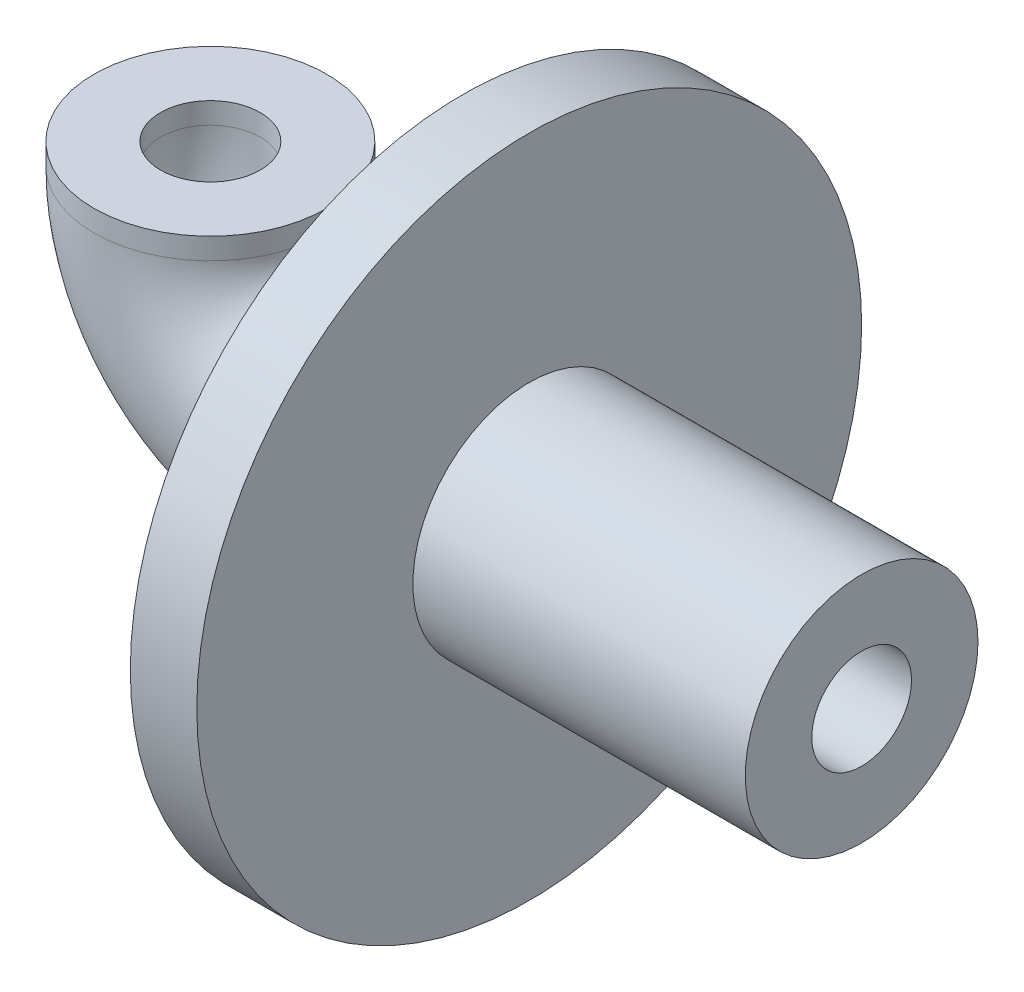
ISO-10303-21;
HEADER;
FILE_DESCRIPTION(('STEP AP214'),'2;1');
FILE_NAME('part.step','',(''),(''),'','','');
FILE_SCHEMA(('AUTOMOTIVE_DESIGN { 1 0 10303 214 1 1 1 1 }'));
ENDSEC;
DATA;
#1=APPLICATION_CONTEXT('core data for automotive mechanical design processes');
#2=APPLICATION_PROTOCOL_DEFINITION('international standard','automotive_design',2000,#1);
#3=PRODUCT_CONTEXT('',#1,'mechanical');
#4=PRODUCT('Part','Part','',(#3));
#5=PRODUCT_RELATED_PRODUCT_CATEGORY('part','',(#4));
#6=PRODUCT_DEFINITION_FORMATION('','',#4);
#7=PRODUCT_DEFINITION_CONTEXT('part definition',#1,'design');
#8=PRODUCT_DEFINITION('design','',#6,#7);
#9=PRODUCT_DEFINITION_SHAPE('','',#8);
#10=(LENGTH_UNIT() NAMED_UNIT(*) SI_UNIT(.MILLI.,.METRE.));
#11=(NAMED_UNIT(*) PLANE_ANGLE_UNIT() SI_UNIT($,.RADIAN.));
#12=(NAMED_UNIT(*) SI_UNIT($,.STERADIAN.) SOLID_ANGLE_UNIT());
#13=UNCERTAINTY_MEASURE_WITH_UNIT(LENGTH_MEASURE(1.E-05),#10,'distance_accuracy_value','');
#14=(GEOMETRIC_REPRESENTATION_CONTEXT(3) GLOBAL_UNCERTAINTY_ASSIGNED_CONTEXT((#13)) GLOBAL_UNIT_ASSIGNED_CONTEXT((#10,
#11,#12)) REPRESENTATION_CONTEXT('',''));
#15=CARTESIAN_POINT('',(0.,0.,0.));
#16=DIRECTION('',(0.,0.,1.));
#17=DIRECTION('',(1.,0.,0.));
#18=AXIS2_PLACEMENT_3D('',#15,#16,#17);
#19=CARTESIAN_POINT('',(1.,0.,0.));
#20=DIRECTION('',(-1.,0.,0.));
#21=DIRECTION('',(0.,0.,1.));
#22=AXIS2_PLACEMENT_3D('',#19,#20,#21);
#23=CYLINDRICAL_SURFACE('',#22,5.);
#24=CARTESIAN_POINT('',(1.,0.,0.));
#25=DIRECTION('',(1.,0.,0.));
#26=DIRECTION('',(0.,0.,-1.));
#27=AXIS2_PLACEMENT_3D('',#24,#25,#26);
#28=CIRCLE('',#27,5.);
#29=CARTESIAN_POINT('',(1.,0.,-5.));
#30=VERTEX_POINT('',#29);
#31=EDGE_CURVE('E44',#30,#30,#28,.T.);
#32=ORIENTED_EDGE('',*,*,#31,.F.);
#33=EDGE_LOOP('',(#32));
#34=FACE_BOUND('',#33,.T.);
#35=CARTESIAN_POINT('',(0.,0.,0.));
#36=DIRECTION('',(1.,0.,0.));
#37=DIRECTION('',(0.,0.,-1.));
#38=AXIS2_PLACEMENT_3D('',#35,#36,#37);
#39=CIRCLE('',#38,5.);
#40=CARTESIAN_POINT('',(0.,0.,-5.));
#41=VERTEX_POINT('',#40);
#42=EDGE_CURVE('E40',#41,#41,#39,.T.);
#43=ORIENTED_EDGE('',*,*,#42,.T.);
#44=EDGE_LOOP('',(#43));
#45=FACE_BOUND('',#44,.T.);
#46=ADVANCED_FACE('F37',(#34,#45),#23,.T.);
#47=CARTESIAN_POINT('',(1.,0.,0.));
#48=DIRECTION('',(1.,0.,0.));
#49=DIRECTION('',(0.,0.,-1.));
#50=AXIS2_PLACEMENT_3D('',#47,#48,#49);
#51=PLANE('',#50);
#52=CARTESIAN_POINT('',(1.,0.,0.));
#53=DIRECTION('',(1.,0.,0.));
#54=DIRECTION('',(0.,0.,-1.));
#55=AXIS2_PLACEMENT_3D('',#52,#53,#54);
#56=CIRCLE('',#55,1.75);
#57=CARTESIAN_POINT('',(1.,0.,-1.75));
#58=VERTEX_POINT('',#57);
#59=EDGE_CURVE('E62',#58,#58,#56,.T.);
#60=ORIENTED_EDGE('',*,*,#59,.F.);
#61=EDGE_LOOP('',(#60));
#62=FACE_BOUND('',#61,.T.);
#63=ORIENTED_EDGE('',*,*,#31,.T.);
#64=EDGE_LOOP('',(#63));
#65=FACE_BOUND('',#64,.T.);
#66=ADVANCED_FACE('F72',(#62,#65),#51,.T.);
#67=CARTESIAN_POINT('',(0.,0.,0.));
#68=DIRECTION('',(1.,0.,0.));
#69=DIRECTION('',(0.,0.,-1.));
#70=AXIS2_PLACEMENT_3D('',#67,#68,#69);
#71=PLANE('',#70);
#72=CARTESIAN_POINT('',(0.,0.,0.));
#73=DIRECTION('',(-1.,0.,0.));
#74=DIRECTION('',(0.,0.,1.));
#75=AXIS2_PLACEMENT_3D('',#72,#73,#74);
#76=CIRCLE('',#75,1.75);
#77=CARTESIAN_POINT('',(0.,0.,1.75));
#78=VERTEX_POINT('',#77);
#79=EDGE_CURVE('E10',#78,#78,#76,.T.);
#80=ORIENTED_EDGE('',*,*,#79,.F.);
#81=EDGE_LOOP('',(#80));
#82=FACE_BOUND('',#81,.T.);
#83=ORIENTED_EDGE('',*,*,#42,.F.);
#84=EDGE_LOOP('',(#83));
#85=FACE_BOUND('',#84,.T.);
#86=ADVANCED_FACE('F75',(#82,#85),#71,.F.);
#87=CARTESIAN_POINT('',(6.,0.,0.));
#88=DIRECTION('',(1.,0.,0.));
#89=DIRECTION('',(0.,0.,-1.));
#90=AXIS2_PLACEMENT_3D('',#87,#88,#89);
#91=PLANE('',#90);
#92=CARTESIAN_POINT('',(6.,0.,0.));
#93=DIRECTION('',(1.,0.,0.));
#94=DIRECTION('',(0.,0.,-1.));
#95=AXIS2_PLACEMENT_3D('',#92,#93,#94);
#96=CIRCLE('',#95,1.75);
#97=CARTESIAN_POINT('',(6.,0.,-1.75));
#98=VERTEX_POINT('',#97);
#99=EDGE_CURVE('E64',#98,#98,#96,.T.);
#100=ORIENTED_EDGE('',*,*,#99,.T.);
#101=EDGE_LOOP('',(#100));
#102=FACE_BOUND('',#101,.T.);
#103=CARTESIAN_POINT('',(6.,0.,0.));
#104=DIRECTION('',(1.,0.,0.));
#105=DIRECTION('',(0.,0.,-1.));
#106=AXIS2_PLACEMENT_3D('',#103,#104,#105);
#107=CIRCLE('',#106,0.75);
#108=CARTESIAN_POINT('',(6.,0.,-0.75));
#109=VERTEX_POINT('',#108);
#110=EDGE_CURVE('E59',#109,#109,#107,.T.);
#111=ORIENTED_EDGE('',*,*,#110,.F.);
#112=EDGE_LOOP('',(#111));
#113=FACE_BOUND('',#112,.T.);
#114=ADVANCED_FACE('F85',(#102,#113),#91,.T.);
#115=CARTESIAN_POINT('',(6.,0.,0.));
#116=DIRECTION('',(-1.,0.,0.));
#117=DIRECTION('',(0.,0.,1.));
#118=AXIS2_PLACEMENT_3D('',#115,#116,#117);
#119=CYLINDRICAL_SURFACE('',#118,1.75);
#120=ORIENTED_EDGE('',*,*,#99,.F.);
#121=EDGE_LOOP('',(#120));
#122=FACE_BOUND('',#121,.T.);
#123=ORIENTED_EDGE('',*,*,#59,.T.);
#124=EDGE_LOOP('',(#123));
#125=FACE_BOUND('',#124,.T.);
#126=ADVANCED_FACE('F70',(#122,#125),#119,.T.);
#127=CARTESIAN_POINT('',(6.,0.,0.));
#128=DIRECTION('',(-1.,0.,0.));
#129=DIRECTION('',(0.,0.,1.));
#130=AXIS2_PLACEMENT_3D('',#127,#128,#129);
#131=CYLINDRICAL_SURFACE('',#130,0.75);
#132=ORIENTED_EDGE('',*,*,#110,.T.);
#133=EDGE_LOOP('',(#132));
#134=FACE_BOUND('',#133,.T.);
#135=CARTESIAN_POINT('',(-1.62315873036789,0.,0.));
#136=DIRECTION('',(-1.,0.,0.));
#137=DIRECTION('',(0.,0.,1.));
#138=AXIS2_PLACEMENT_3D('',#135,#136,#137);
#139=CIRCLE('',#138,0.75);
#140=CARTESIAN_POINT('',(-1.62315873036789,-0.75,0.));
#141=VERTEX_POINT('',#140);
#142=EDGE_CURVE('E131',#141,#141,#139,.F.);
#143=ORIENTED_EDGE('',*,*,#142,.F.);
#144=EDGE_LOOP('',(#143));
#145=FACE_BOUND('',#144,.T.);
#146=ADVANCED_FACE('F94',(#134,#145),#131,.F.);
#147=CARTESIAN_POINT('',(0.,0.,0.));
#148=DIRECTION('',(-1.,0.,0.));
#149=DIRECTION('',(0.,0.,1.));
#150=AXIS2_PLACEMENT_3D('',#147,#148,#149);
#151=CYLINDRICAL_SURFACE('',#150,1.75);
#152=CARTESIAN_POINT('',(-1.62315873036789,0.,0.));
#153=DIRECTION('',(-1.,0.,0.));
#154=DIRECTION('',(0.,0.,1.));
#155=AXIS2_PLACEMENT_3D('',#152,#153,#154);
#156=CIRCLE('',#155,1.75);
#157=CARTESIAN_POINT('',(-1.62315873036789,-1.75,0.));
#158=VERTEX_POINT('',#157);
#159=EDGE_CURVE('E53',#158,#158,#156,.T.);
#160=ORIENTED_EDGE('',*,*,#159,.F.);
#161=EDGE_LOOP('',(#160));
#162=FACE_BOUND('',#161,.T.);
#163=ORIENTED_EDGE('',*,*,#79,.T.);
#164=EDGE_LOOP('',(#163));
#165=FACE_BOUND('',#164,.T.);
#166=ADVANCED_FACE('F99',(#162,#165),#151,.T.);
#167=CARTESIAN_POINT('',(-1.62315873036789,2.17237794198093,0.));
#168=DIRECTION('',(0.,0.,-1.));
#169=DIRECTION('',(-1.,0.,0.));
#170=AXIS2_PLACEMENT_3D('',#167,#168,#169);
#171=TOROIDAL_SURFACE('',#170,2.17237794198093,1.75);
#172=CARTESIAN_POINT('',(-3.79553667234882,2.17237794198093,0.));
#173=DIRECTION('',(0.,1.,0.));
#174=DIRECTION('',(0.,0.,1.));
#175=AXIS2_PLACEMENT_3D('',#172,#173,#174);
#176=CIRCLE('',#175,1.75);
#177=CARTESIAN_POINT('',(-5.54553667234882,2.17237794198093,0.));
#178=VERTEX_POINT('',#177);
#179=EDGE_CURVE('E56',#178,#178,#176,.T.);
#180=CARTESIAN_POINT('',(-1.62315873036789,2.17237794198093,0.));
#181=DIRECTION('',(0.,0.,-1.));
#182=DIRECTION('',(-1.,0.,0.));
#183=AXIS2_PLACEMENT_3D('',#180,#181,#182);
#184=CIRCLE('',#183,3.92237794198093);
#185=EDGE_CURVE('',#158,#178,#184,.T.);
#186=ORIENTED_EDGE('',*,*,#159,.T.);
#187=ORIENTED_EDGE('',*,*,#179,.F.);
#188=ORIENTED_EDGE('',*,*,#185,.T.);
#189=ORIENTED_EDGE('',*,*,#185,.F.);
#190=EDGE_LOOP('',(#186,#188,#187,#189));
#191=FACE_BOUND('',#190,.T.);
#192=ADVANCED_FACE('F106',(#191),#171,.T.);
#193=CARTESIAN_POINT('',(-3.79553667234882,2.17237794198093,0.));
#194=DIRECTION('',(0.,1.,0.));
#195=DIRECTION('',(0.,0.,1.));
#196=AXIS2_PLACEMENT_3D('',#193,#194,#195);
#197=CYLINDRICAL_SURFACE('',#196,1.75);
#198=CARTESIAN_POINT('',(-3.79553667234882,2.49274450035841,0.));
#199=DIRECTION('',(0.,1.,0.));
#200=DIRECTION('',(0.,0.,1.));
#201=AXIS2_PLACEMENT_3D('',#198,#199,#200);
#202=CIRCLE('',#201,1.75);
#203=CARTESIAN_POINT('',(-3.79553667234882,2.49274450035841,1.75));
#204=VERTEX_POINT('',#203);
#205=EDGE_CURVE('E51',#204,#204,#202,.T.);
#206=ORIENTED_EDGE('',*,*,#205,.F.);
#207=EDGE_LOOP('',(#206));
#208=FACE_BOUND('',#207,.T.);
#209=ORIENTED_EDGE('',*,*,#179,.T.);
#210=EDGE_LOOP('',(#209));
#211=FACE_BOUND('',#210,.T.);
#212=ADVANCED_FACE('F102',(#208,#211),#197,.T.);
#213=CARTESIAN_POINT('',(-3.79553667234882,2.49274450035841,0.));
#214=DIRECTION('',(0.,1.,0.));
#215=DIRECTION('',(0.,0.,1.));
#216=AXIS2_PLACEMENT_3D('',#213,#214,#215);
#217=PLANE('',#216);
#218=CARTESIAN_POINT('',(-3.79553667234882,2.49274450035841,0.));
#219=DIRECTION('',(0.,1.,0.));
#220=DIRECTION('',(0.,0.,1.));
#221=AXIS2_PLACEMENT_3D('',#218,#219,#220);
#222=CIRCLE('',#221,0.75);
#223=CARTESIAN_POINT('',(-3.79553667234882,2.49274450035841,0.75));
#224=VERTEX_POINT('',#223);
#225=EDGE_CURVE('E63',#224,#224,#222,.F.);
#226=ORIENTED_EDGE('',*,*,#225,.T.);
#227=EDGE_LOOP('',(#226));
#228=FACE_BOUND('',#227,.T.);
#229=ORIENTED_EDGE('',*,*,#205,.T.);
#230=EDGE_LOOP('',(#229));
#231=FACE_BOUND('',#230,.T.);
#232=ADVANCED_FACE('F105',(#228,#231),#217,.T.);
#233=CARTESIAN_POINT('',(-1.62315873036789,2.17237794198093,0.));
#234=DIRECTION('',(0.,0.,-1.));
#235=DIRECTION('',(-1.,0.,0.));
#236=AXIS2_PLACEMENT_3D('',#233,#234,#235);
#237=TOROIDAL_SURFACE('',#236,2.17237794198093,0.75);
#238=CARTESIAN_POINT('',(-3.79553667234882,2.17237794198093,0.));
#239=DIRECTION('',(0.,1.,0.));
#240=DIRECTION('',(0.,0.,1.));
#241=AXIS2_PLACEMENT_3D('',#238,#239,#240);
#242=CIRCLE('',#241,0.75);
#243=CARTESIAN_POINT('',(-4.54553667234882,2.17237794198093,0.));
#244=VERTEX_POINT('',#243);
#245=EDGE_CURVE('E128',#244,#244,#242,.F.);
#246=CARTESIAN_POINT('',(-1.62315873036789,2.17237794198093,0.));
#247=DIRECTION('',(0.,0.,-1.));
#248=DIRECTION('',(-1.,0.,0.));
#249=AXIS2_PLACEMENT_3D('',#246,#247,#248);
#250=CIRCLE('',#249,2.92237794198093);
#251=EDGE_CURVE('',#141,#244,#250,.T.);
#252=ORIENTED_EDGE('',*,*,#142,.T.);
#253=ORIENTED_EDGE('',*,*,#245,.F.);
#254=ORIENTED_EDGE('',*,*,#251,.T.);
#255=ORIENTED_EDGE('',*,*,#251,.F.);
#256=EDGE_LOOP('',(#252,#254,#253,#255));
#257=FACE_BOUND('',#256,.T.);
#258=ADVANCED_FACE('F116',(#257),#237,.F.);
#259=CARTESIAN_POINT('',(-3.79553667234882,2.17237794198093,0.));
#260=DIRECTION('',(0.,1.,0.));
#261=DIRECTION('',(0.,0.,1.));
#262=AXIS2_PLACEMENT_3D('',#259,#260,#261);
#263=CYLINDRICAL_SURFACE('',#262,0.75);
#264=ORIENTED_EDGE('',*,*,#225,.F.);
#265=EDGE_LOOP('',(#264));
#266=FACE_BOUND('',#265,.T.);
#267=ORIENTED_EDGE('',*,*,#245,.T.);
#268=EDGE_LOOP('',(#267));
#269=FACE_BOUND('',#268,.T.);
#270=ADVANCED_FACE('F101',(#266,#269),#263,.F.);
#271=CLOSED_SHELL('',(#46,#66,#86,#114,#126,#146,#166,#192,#212,#232,#258,#270));
#272=MANIFOLD_SOLID_BREP('B2',#271);
#273=ADVANCED_BREP_SHAPE_REPRESENTATION('',(#18,#272),#14);
#274=SHAPE_DEFINITION_REPRESENTATION(#9,#273);
ENDSEC;
END-ISO-10303-21;
